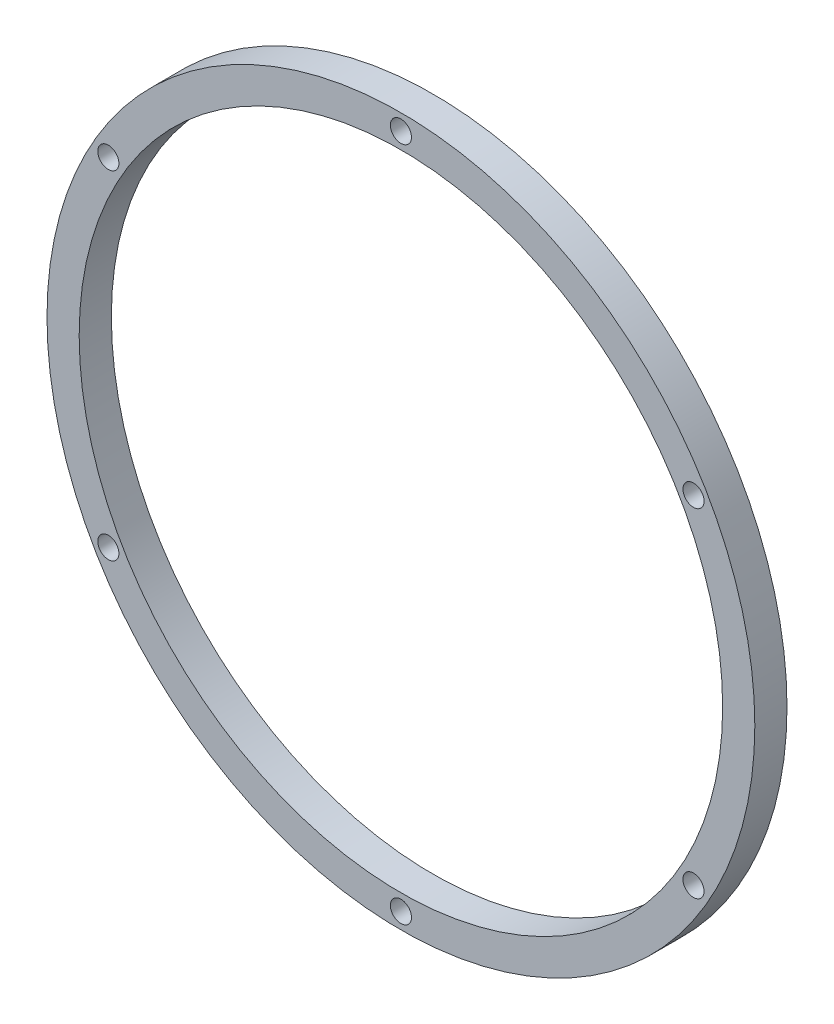
ISO-10303-21;
HEADER;
FILE_DESCRIPTION(('STEP AP214'),'2;1');
FILE_NAME('part.step','',(''),(''),'','','');
FILE_SCHEMA(('AUTOMOTIVE_DESIGN { 1 0 10303 214 1 1 1 1 }'));
ENDSEC;
DATA;
#1=APPLICATION_CONTEXT('core data for automotive mechanical design processes');
#2=APPLICATION_PROTOCOL_DEFINITION('international standard','automotive_design',2000,#1);
#3=PRODUCT_CONTEXT('',#1,'mechanical');
#4=PRODUCT('Part','Part','',(#3));
#5=PRODUCT_RELATED_PRODUCT_CATEGORY('part','',(#4));
#6=PRODUCT_DEFINITION_FORMATION('','',#4);
#7=PRODUCT_DEFINITION_CONTEXT('part definition',#1,'design');
#8=PRODUCT_DEFINITION('design','',#6,#7);
#9=PRODUCT_DEFINITION_SHAPE('','',#8);
#10=(LENGTH_UNIT() NAMED_UNIT(*) SI_UNIT(.MILLI.,.METRE.));
#11=(NAMED_UNIT(*) PLANE_ANGLE_UNIT() SI_UNIT($,.RADIAN.));
#12=(NAMED_UNIT(*) SI_UNIT($,.STERADIAN.) SOLID_ANGLE_UNIT());
#13=UNCERTAINTY_MEASURE_WITH_UNIT(LENGTH_MEASURE(1.E-05),#10,'distance_accuracy_value','');
#14=(GEOMETRIC_REPRESENTATION_CONTEXT(3) GLOBAL_UNCERTAINTY_ASSIGNED_CONTEXT((#13)) GLOBAL_UNIT_ASSIGNED_CONTEXT((#10,
#11,#12)) REPRESENTATION_CONTEXT('',''));
#15=CARTESIAN_POINT('',(0.,0.,0.));
#16=DIRECTION('',(0.,0.,1.));
#17=DIRECTION('',(1.,0.,0.));
#18=AXIS2_PLACEMENT_3D('',#15,#16,#17);
#19=CARTESIAN_POINT('',(26.6274243469979,39.834794983733,6.35));
#20=DIRECTION('',(0.,0.,1.));
#21=DIRECTION('',(1.,0.,0.));
#22=AXIS2_PLACEMENT_3D('',#19,#20,#21);
#23=PLANE('',#22);
#24=CARTESIAN_POINT('',(26.6274243469979,106.509794983733,6.35));
#25=DIRECTION('',(0.,0.,1.));
#26=DIRECTION('',(1.,0.,0.));
#27=AXIS2_PLACEMENT_3D('',#24,#25,#26);
#28=CIRCLE('',#27,2.085);
#29=CARTESIAN_POINT('',(28.7124243469979,106.509794983733,6.35));
#30=VERTEX_POINT('',#29);
#31=EDGE_CURVE('E53',#30,#30,#28,.T.);
#32=ORIENTED_EDGE('',*,*,#31,.F.);
#33=EDGE_LOOP('',(#32));
#34=FACE_BOUND('',#33,.T.);
#35=CARTESIAN_POINT('',(-31.1148194503286,73.1722949837329,6.35));
#36=DIRECTION('',(0.,0.,1.));
#37=DIRECTION('',(1.,0.,0.));
#38=AXIS2_PLACEMENT_3D('',#35,#36,#37);
#39=CIRCLE('',#38,2.085);
#40=CARTESIAN_POINT('',(-29.0298194503286,73.1722949837329,6.35));
#41=VERTEX_POINT('',#40);
#42=EDGE_CURVE('E79',#41,#41,#39,.T.);
#43=ORIENTED_EDGE('',*,*,#42,.F.);
#44=EDGE_LOOP('',(#43));
#45=FACE_BOUND('',#44,.T.);
#46=CARTESIAN_POINT('',(-31.1148194503285,6.49729498373272,6.35));
#47=DIRECTION('',(0.,0.,1.));
#48=DIRECTION('',(1.,0.,0.));
#49=AXIS2_PLACEMENT_3D('',#46,#47,#48);
#50=CIRCLE('',#49,2.08499999999999);
#51=CARTESIAN_POINT('',(-29.0298194503285,6.49729498373272,6.35));
#52=VERTEX_POINT('',#51);
#53=EDGE_CURVE('E75',#52,#52,#50,.T.);
#54=ORIENTED_EDGE('',*,*,#53,.F.);
#55=EDGE_LOOP('',(#54));
#56=FACE_BOUND('',#55,.T.);
#57=CARTESIAN_POINT('',(26.6274243469993,-26.840205016267,6.35));
#58=DIRECTION('',(0.,0.,1.));
#59=DIRECTION('',(1.,0.,0.));
#60=AXIS2_PLACEMENT_3D('',#57,#58,#59);
#61=CIRCLE('',#60,2.085);
#62=CARTESIAN_POINT('',(28.7124243469993,-26.840205016267,6.35));
#63=VERTEX_POINT('',#62);
#64=EDGE_CURVE('E78',#63,#63,#61,.T.);
#65=ORIENTED_EDGE('',*,*,#64,.F.);
#66=EDGE_LOOP('',(#65));
#67=FACE_BOUND('',#66,.T.);
#68=CARTESIAN_POINT('',(84.3696681443267,6.49729498373353,6.35));
#69=DIRECTION('',(0.,0.,1.));
#70=DIRECTION('',(1.,0.,0.));
#71=AXIS2_PLACEMENT_3D('',#68,#69,#70);
#72=CIRCLE('',#71,2.085);
#73=CARTESIAN_POINT('',(86.4546681443267,6.49729498373353,6.35));
#74=VERTEX_POINT('',#73);
#75=EDGE_CURVE('E82',#74,#74,#72,.T.);
#76=ORIENTED_EDGE('',*,*,#75,.F.);
#77=EDGE_LOOP('',(#76));
#78=FACE_BOUND('',#77,.T.);
#79=CARTESIAN_POINT('',(84.3696681443259,73.1722949837337,6.35));
#80=DIRECTION('',(0.,0.,1.));
#81=DIRECTION('',(1.,0.,0.));
#82=AXIS2_PLACEMENT_3D('',#79,#80,#81);
#83=CIRCLE('',#82,2.085);
#84=CARTESIAN_POINT('',(86.4546681443259,73.1722949837337,6.35));
#85=VERTEX_POINT('',#84);
#86=EDGE_CURVE('E85',#85,#85,#83,.T.);
#87=ORIENTED_EDGE('',*,*,#86,.F.);
#88=EDGE_LOOP('',(#87));
#89=FACE_BOUND('',#88,.T.);
#90=CARTESIAN_POINT('',(26.6274243469979,39.834794983733,6.35));
#91=DIRECTION('',(0.,0.,1.));
#92=DIRECTION('',(1.,0.,0.));
#93=AXIS2_PLACEMENT_3D('',#90,#91,#92);
#94=CIRCLE('',#93,69.85);
#95=CARTESIAN_POINT('',(96.4774243469979,39.834794983733,6.35));
#96=VERTEX_POINT('',#95);
#97=EDGE_CURVE('E10',#96,#96,#94,.T.);
#98=ORIENTED_EDGE('',*,*,#97,.T.);
#99=EDGE_LOOP('',(#98));
#100=FACE_BOUND('',#99,.T.);
#101=CARTESIAN_POINT('',(26.6274243469979,39.834794983733,6.35));
#102=DIRECTION('',(0.,0.,1.));
#103=DIRECTION('',(1.,0.,0.));
#104=AXIS2_PLACEMENT_3D('',#101,#102,#103);
#105=CIRCLE('',#104,63.5);
#106=CARTESIAN_POINT('',(90.1274243469979,39.834794983733,6.35));
#107=VERTEX_POINT('',#106);
#108=EDGE_CURVE('E43',#107,#107,#105,.T.);
#109=ORIENTED_EDGE('',*,*,#108,.F.);
#110=EDGE_LOOP('',(#109));
#111=FACE_BOUND('',#110,.T.);
#112=ADVANCED_FACE('F30',(#34,#45,#56,#67,#78,#89,#100,#111),#23,.T.);
#113=CARTESIAN_POINT('',(26.6274243469979,39.834794983733,0.));
#114=DIRECTION('',(0.,0.,1.));
#115=DIRECTION('',(1.,0.,0.));
#116=AXIS2_PLACEMENT_3D('',#113,#114,#115);
#117=PLANE('',#116);
#118=CARTESIAN_POINT('',(26.6274243469979,106.509794983733,0.));
#119=DIRECTION('',(0.,0.,1.));
#120=DIRECTION('',(1.,0.,0.));
#121=AXIS2_PLACEMENT_3D('',#118,#119,#120);
#122=CIRCLE('',#121,2.085);
#123=CARTESIAN_POINT('',(28.7124243469979,106.509794983733,0.));
#124=VERTEX_POINT('',#123);
#125=EDGE_CURVE('E34',#124,#124,#122,.T.);
#126=ORIENTED_EDGE('',*,*,#125,.T.);
#127=EDGE_LOOP('',(#126));
#128=FACE_BOUND('',#127,.T.);
#129=CARTESIAN_POINT('',(-31.1148194503286,73.1722949837329,0.));
#130=DIRECTION('',(0.,0.,1.));
#131=DIRECTION('',(1.,0.,0.));
#132=AXIS2_PLACEMENT_3D('',#129,#130,#131);
#133=CIRCLE('',#132,2.085);
#134=CARTESIAN_POINT('',(-29.0298194503286,73.1722949837329,0.));
#135=VERTEX_POINT('',#134);
#136=EDGE_CURVE('E61',#135,#135,#133,.T.);
#137=ORIENTED_EDGE('',*,*,#136,.T.);
#138=EDGE_LOOP('',(#137));
#139=FACE_BOUND('',#138,.T.);
#140=CARTESIAN_POINT('',(-31.1148194503285,6.49729498373272,0.));
#141=DIRECTION('',(0.,0.,1.));
#142=DIRECTION('',(1.,0.,0.));
#143=AXIS2_PLACEMENT_3D('',#140,#141,#142);
#144=CIRCLE('',#143,2.08499999999999);
#145=CARTESIAN_POINT('',(-29.0298194503285,6.49729498373272,0.));
#146=VERTEX_POINT('',#145);
#147=EDGE_CURVE('E59',#146,#146,#144,.T.);
#148=ORIENTED_EDGE('',*,*,#147,.T.);
#149=EDGE_LOOP('',(#148));
#150=FACE_BOUND('',#149,.T.);
#151=CARTESIAN_POINT('',(26.6274243469993,-26.840205016267,0.));
#152=DIRECTION('',(0.,0.,1.));
#153=DIRECTION('',(1.,0.,0.));
#154=AXIS2_PLACEMENT_3D('',#151,#152,#153);
#155=CIRCLE('',#154,2.085);
#156=CARTESIAN_POINT('',(28.7124243469993,-26.840205016267,0.));
#157=VERTEX_POINT('',#156);
#158=EDGE_CURVE('E56',#157,#157,#155,.T.);
#159=ORIENTED_EDGE('',*,*,#158,.T.);
#160=EDGE_LOOP('',(#159));
#161=FACE_BOUND('',#160,.T.);
#162=CARTESIAN_POINT('',(84.3696681443267,6.49729498373353,0.));
#163=DIRECTION('',(0.,0.,1.));
#164=DIRECTION('',(1.,0.,0.));
#165=AXIS2_PLACEMENT_3D('',#162,#163,#164);
#166=CIRCLE('',#165,2.085);
#167=CARTESIAN_POINT('',(86.4546681443267,6.49729498373353,0.));
#168=VERTEX_POINT('',#167);
#169=EDGE_CURVE('E52',#168,#168,#166,.T.);
#170=ORIENTED_EDGE('',*,*,#169,.T.);
#171=EDGE_LOOP('',(#170));
#172=FACE_BOUND('',#171,.T.);
#173=CARTESIAN_POINT('',(84.3696681443259,73.1722949837337,0.));
#174=DIRECTION('',(0.,0.,1.));
#175=DIRECTION('',(1.,0.,0.));
#176=AXIS2_PLACEMENT_3D('',#173,#174,#175);
#177=CIRCLE('',#176,2.085);
#178=CARTESIAN_POINT('',(86.4546681443259,73.1722949837337,0.));
#179=VERTEX_POINT('',#178);
#180=EDGE_CURVE('E49',#179,#179,#177,.T.);
#181=ORIENTED_EDGE('',*,*,#180,.T.);
#182=EDGE_LOOP('',(#181));
#183=FACE_BOUND('',#182,.T.);
#184=CARTESIAN_POINT('',(26.6274243469979,39.834794983733,0.));
#185=DIRECTION('',(0.,0.,1.));
#186=DIRECTION('',(1.,0.,0.));
#187=AXIS2_PLACEMENT_3D('',#184,#185,#186);
#188=CIRCLE('',#187,69.85);
#189=CARTESIAN_POINT('',(96.4774243469979,39.834794983733,0.));
#190=VERTEX_POINT('',#189);
#191=EDGE_CURVE('E38',#190,#190,#188,.T.);
#192=ORIENTED_EDGE('',*,*,#191,.F.);
#193=EDGE_LOOP('',(#192));
#194=FACE_BOUND('',#193,.T.);
#195=CARTESIAN_POINT('',(26.6274243469979,39.834794983733,0.));
#196=DIRECTION('',(0.,0.,1.));
#197=DIRECTION('',(1.,0.,0.));
#198=AXIS2_PLACEMENT_3D('',#195,#196,#197);
#199=CIRCLE('',#198,63.5);
#200=CARTESIAN_POINT('',(90.1274243469979,39.834794983733,0.));
#201=VERTEX_POINT('',#200);
#202=EDGE_CURVE('E46',#201,#201,#199,.T.);
#203=ORIENTED_EDGE('',*,*,#202,.T.);
#204=EDGE_LOOP('',(#203));
#205=FACE_BOUND('',#204,.T.);
#206=ADVANCED_FACE('F98',(#128,#139,#150,#161,#172,#183,#194,#205),#117,.F.);
#207=CARTESIAN_POINT('',(26.6274243469979,39.834794983733,6.35));
#208=DIRECTION('',(0.,0.,-1.));
#209=DIRECTION('',(-1.,0.,0.));
#210=AXIS2_PLACEMENT_3D('',#207,#208,#209);
#211=CYLINDRICAL_SURFACE('',#210,69.85);
#212=ORIENTED_EDGE('',*,*,#97,.F.);
#213=EDGE_LOOP('',(#212));
#214=FACE_BOUND('',#213,.T.);
#215=ORIENTED_EDGE('',*,*,#191,.T.);
#216=EDGE_LOOP('',(#215));
#217=FACE_BOUND('',#216,.T.);
#218=ADVANCED_FACE('F32',(#214,#217),#211,.T.);
#219=CARTESIAN_POINT('',(26.6274243469979,39.834794983733,6.35));
#220=DIRECTION('',(0.,0.,-1.));
#221=DIRECTION('',(-1.,0.,0.));
#222=AXIS2_PLACEMENT_3D('',#219,#220,#221);
#223=CYLINDRICAL_SURFACE('',#222,63.5);
#224=ORIENTED_EDGE('',*,*,#108,.T.);
#225=EDGE_LOOP('',(#224));
#226=FACE_BOUND('',#225,.T.);
#227=ORIENTED_EDGE('',*,*,#202,.F.);
#228=EDGE_LOOP('',(#227));
#229=FACE_BOUND('',#228,.T.);
#230=ADVANCED_FACE('F115',(#226,#229),#223,.F.);
#231=CARTESIAN_POINT('',(84.3696681443259,73.1722949837337,-14.986));
#232=DIRECTION('',(0.,0.,1.));
#233=DIRECTION('',(1.,0.,0.));
#234=AXIS2_PLACEMENT_3D('',#231,#232,#233);
#235=CYLINDRICAL_SURFACE('',#234,2.085);
#236=ORIENTED_EDGE('',*,*,#86,.T.);
#237=EDGE_LOOP('',(#236));
#238=FACE_BOUND('',#237,.T.);
#239=ORIENTED_EDGE('',*,*,#180,.F.);
#240=EDGE_LOOP('',(#239));
#241=FACE_BOUND('',#240,.T.);
#242=ADVANCED_FACE('F111',(#238,#241),#235,.F.);
#243=CARTESIAN_POINT('',(84.3696681443267,6.49729498373353,-14.986));
#244=DIRECTION('',(0.,0.,1.));
#245=DIRECTION('',(1.,0.,0.));
#246=AXIS2_PLACEMENT_3D('',#243,#244,#245);
#247=CYLINDRICAL_SURFACE('',#246,2.085);
#248=ORIENTED_EDGE('',*,*,#75,.T.);
#249=EDGE_LOOP('',(#248));
#250=FACE_BOUND('',#249,.T.);
#251=ORIENTED_EDGE('',*,*,#169,.F.);
#252=EDGE_LOOP('',(#251));
#253=FACE_BOUND('',#252,.T.);
#254=ADVANCED_FACE('F114',(#250,#253),#247,.F.);
#255=CARTESIAN_POINT('',(26.6274243469993,-26.840205016267,-14.986));
#256=DIRECTION('',(0.,0.,1.));
#257=DIRECTION('',(1.,0.,0.));
#258=AXIS2_PLACEMENT_3D('',#255,#256,#257);
#259=CYLINDRICAL_SURFACE('',#258,2.085);
#260=ORIENTED_EDGE('',*,*,#64,.T.);
#261=EDGE_LOOP('',(#260));
#262=FACE_BOUND('',#261,.T.);
#263=ORIENTED_EDGE('',*,*,#158,.F.);
#264=EDGE_LOOP('',(#263));
#265=FACE_BOUND('',#264,.T.);
#266=ADVANCED_FACE('F137',(#262,#265),#259,.F.);
#267=CARTESIAN_POINT('',(-31.1148194503285,6.49729498373272,-14.986));
#268=DIRECTION('',(0.,0.,1.));
#269=DIRECTION('',(1.,0.,0.));
#270=AXIS2_PLACEMENT_3D('',#267,#268,#269);
#271=CYLINDRICAL_SURFACE('',#270,2.08499999999999);
#272=ORIENTED_EDGE('',*,*,#53,.T.);
#273=EDGE_LOOP('',(#272));
#274=FACE_BOUND('',#273,.T.);
#275=ORIENTED_EDGE('',*,*,#147,.F.);
#276=EDGE_LOOP('',(#275));
#277=FACE_BOUND('',#276,.T.);
#278=ADVANCED_FACE('F133',(#274,#277),#271,.F.);
#279=CARTESIAN_POINT('',(-31.1148194503286,73.1722949837329,-14.986));
#280=DIRECTION('',(0.,0.,1.));
#281=DIRECTION('',(1.,0.,0.));
#282=AXIS2_PLACEMENT_3D('',#279,#280,#281);
#283=CYLINDRICAL_SURFACE('',#282,2.085);
#284=ORIENTED_EDGE('',*,*,#42,.T.);
#285=EDGE_LOOP('',(#284));
#286=FACE_BOUND('',#285,.T.);
#287=ORIENTED_EDGE('',*,*,#136,.F.);
#288=EDGE_LOOP('',(#287));
#289=FACE_BOUND('',#288,.T.);
#290=ADVANCED_FACE('F136',(#286,#289),#283,.F.);
#291=CARTESIAN_POINT('',(26.6274243469979,106.509794983733,-14.986));
#292=DIRECTION('',(0.,0.,1.));
#293=DIRECTION('',(1.,0.,0.));
#294=AXIS2_PLACEMENT_3D('',#291,#292,#293);
#295=CYLINDRICAL_SURFACE('',#294,2.085);
#296=ORIENTED_EDGE('',*,*,#31,.T.);
#297=EDGE_LOOP('',(#296));
#298=FACE_BOUND('',#297,.T.);
#299=ORIENTED_EDGE('',*,*,#125,.F.);
#300=EDGE_LOOP('',(#299));
#301=FACE_BOUND('',#300,.T.);
#302=ADVANCED_FACE('F93',(#298,#301),#295,.F.);
#303=CLOSED_SHELL('',(#112,#206,#218,#230,#242,#254,#266,#278,#290,#302));
#304=MANIFOLD_SOLID_BREP('B2',#303);
#305=ADVANCED_BREP_SHAPE_REPRESENTATION('',(#18,#304),#14);
#306=SHAPE_DEFINITION_REPRESENTATION(#9,#305);
ENDSEC;
END-ISO-10303-21;
